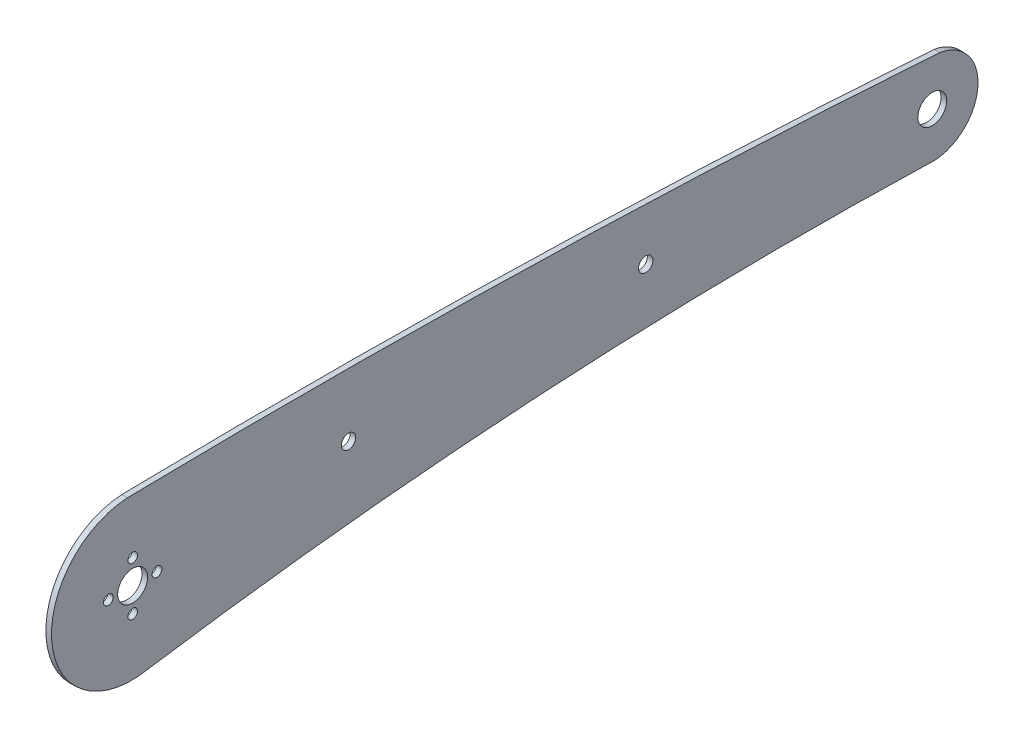
ISO-10303-21;
HEADER;
FILE_DESCRIPTION(('STEP AP214'),'2;1');
FILE_NAME('part.step','',(''),(''),'','','');
FILE_SCHEMA(('AUTOMOTIVE_DESIGN { 1 0 10303 214 1 1 1 1 }'));
ENDSEC;
DATA;
#1=APPLICATION_CONTEXT('core data for automotive mechanical design processes');
#2=APPLICATION_PROTOCOL_DEFINITION('international standard','automotive_design',2000,#1);
#3=PRODUCT_CONTEXT('',#1,'mechanical');
#4=PRODUCT('Part','Part','',(#3));
#5=PRODUCT_RELATED_PRODUCT_CATEGORY('part','',(#4));
#6=PRODUCT_DEFINITION_FORMATION('','',#4);
#7=PRODUCT_DEFINITION_CONTEXT('part definition',#1,'design');
#8=PRODUCT_DEFINITION('design','',#6,#7);
#9=PRODUCT_DEFINITION_SHAPE('','',#8);
#10=(LENGTH_UNIT() NAMED_UNIT(*) SI_UNIT(.MILLI.,.METRE.));
#11=(NAMED_UNIT(*) PLANE_ANGLE_UNIT() SI_UNIT($,.RADIAN.));
#12=(NAMED_UNIT(*) SI_UNIT($,.STERADIAN.) SOLID_ANGLE_UNIT());
#13=UNCERTAINTY_MEASURE_WITH_UNIT(LENGTH_MEASURE(1.E-05),#10,'distance_accuracy_value','');
#14=(GEOMETRIC_REPRESENTATION_CONTEXT(3) GLOBAL_UNCERTAINTY_ASSIGNED_CONTEXT((#13)) GLOBAL_UNIT_ASSIGNED_CONTEXT((#10,
#11,#12)) REPRESENTATION_CONTEXT('',''));
#15=CARTESIAN_POINT('',(0.,0.,0.));
#16=DIRECTION('',(0.,0.,1.));
#17=DIRECTION('',(1.,0.,0.));
#18=AXIS2_PLACEMENT_3D('',#15,#16,#17);
#19=CARTESIAN_POINT('',(1.5,0.0109238249300647,-111.842380336312));
#20=DIRECTION('',(1.,0.,0.));
#21=DIRECTION('',(0.,0.,-1.));
#22=AXIS2_PLACEMENT_3D('',#19,#20,#21);
#23=PLANE('',#22);
#24=CARTESIAN_POINT('',(1.5,4.68666504729787,44.4328136526777));
#25=DIRECTION('',(1.,0.,0.));
#26=DIRECTION('',(0.,0.,-1.));
#27=AXIS2_PLACEMENT_3D('',#24,#25,#26);
#28=CIRCLE('',#27,1.92499999999995);
#29=CARTESIAN_POINT('',(1.5,4.68666504729787,42.5078136526778));
#30=VERTEX_POINT('',#29);
#31=EDGE_CURVE('E187',#30,#30,#28,.T.);
#32=ORIENTED_EDGE('',*,*,#31,.F.);
#33=EDGE_LOOP('',(#32));
#34=FACE_BOUND('',#33,.T.);
#35=CARTESIAN_POINT('',(1.5,0.133331517138124,102.143981394812));
#36=DIRECTION('',(1.,0.,0.));
#37=DIRECTION('',(0.,0.,-1.));
#38=AXIS2_PLACEMENT_3D('',#35,#36,#37);
#39=CIRCLE('',#38,4.00000000000001);
#40=CARTESIAN_POINT('',(1.5,0.133331517138124,98.1439813948124));
#41=VERTEX_POINT('',#40);
#42=EDGE_CURVE('E199',#41,#41,#39,.T.);
#43=ORIENTED_EDGE('',*,*,#42,.F.);
#44=EDGE_LOOP('',(#43));
#45=FACE_BOUND('',#44,.T.);
#46=CARTESIAN_POINT('',(1.5,-6.36666848286188,102.143981394812));
#47=DIRECTION('',(1.,0.,0.));
#48=DIRECTION('',(0.,0.,-1.));
#49=AXIS2_PLACEMENT_3D('',#46,#47,#48);
#50=CIRCLE('',#49,1.29999999999999);
#51=CARTESIAN_POINT('',(1.5,-6.36666848286188,100.843981394812));
#52=VERTEX_POINT('',#51);
#53=EDGE_CURVE('E211',#52,#52,#50,.T.);
#54=ORIENTED_EDGE('',*,*,#53,.F.);
#55=EDGE_LOOP('',(#54));
#56=FACE_BOUND('',#55,.T.);
#57=CARTESIAN_POINT('',(1.5,6.63333151713812,102.143981394812));
#58=DIRECTION('',(1.,0.,0.));
#59=DIRECTION('',(0.,0.,-1.));
#60=AXIS2_PLACEMENT_3D('',#57,#58,#59);
#61=CIRCLE('',#60,1.29999999999999);
#62=CARTESIAN_POINT('',(1.5,6.63333151713812,100.843981394812));
#63=VERTEX_POINT('',#62);
#64=EDGE_CURVE('E111',#63,#63,#61,.T.);
#65=ORIENTED_EDGE('',*,*,#64,.F.);
#66=EDGE_LOOP('',(#65));
#67=FACE_BOUND('',#66,.T.);
#68=CARTESIAN_POINT('',(1.5,-3.59948538258381,-112.079421326813));
#69=DIRECTION('',(1.,0.,0.));
#70=DIRECTION('',(0.,0.,-1.));
#71=AXIS2_PLACEMENT_3D('',#68,#69,#70);
#72=CIRCLE('',#71,4.9999999999999);
#73=CARTESIAN_POINT('',(1.5,-8.57201186270506,-111.555989951663));
#74=VERTEX_POINT('',#73);
#75=CARTESIAN_POINT('',(1.5,-8.58874368837342,-112.406990492162));
#76=VERTEX_POINT('',#75);
#77=EDGE_CURVE('E116',#74,#76,#72,.T.);
#78=ORIENTED_EDGE('',*,*,#77,.T.);
#79=CARTESIAN_POINT('',(1.5,3.62133303244394,-111.605339345811));
#80=DIRECTION('',(1.,0.,0.));
#81=DIRECTION('',(0.,0.,-1.));
#82=AXIS2_PLACEMENT_3D('',#79,#80,#81);
#83=CIRCLE('',#82,12.2363645781209);
#84=CARTESIAN_POINT('',(1.5,15.6965768285633,-113.584507189356));
#85=VERTEX_POINT('',#84);
#86=EDGE_CURVE('E83',#76,#85,#83,.T.);
#87=ORIENTED_EDGE('',*,*,#86,.T.);
#88=CARTESIAN_POINT('',(1.5,-2413.07294376536,56.6324226054489));
#89=DIRECTION('',(1.,0.,0.));
#90=DIRECTION('',(0.,0.,-1.));
#91=AXIS2_PLACEMENT_3D('',#88,#89,#90);
#92=CIRCLE('',#91,2434.72692254281);
#93=CARTESIAN_POINT('',(1.5,21.2020403196569,103.541794938654));
#94=VERTEX_POINT('',#93);
#95=EDGE_CURVE('E87',#85,#94,#92,.T.);
#96=ORIENTED_EDGE('',*,*,#95,.T.);
#97=CARTESIAN_POINT('',(1.5,-0.210717527640014,102.398442674119));
#98=DIRECTION('',(1.,0.,0.));
#99=DIRECTION('',(0.,0.,-1.));
#100=AXIS2_PLACEMENT_3D('',#97,#98,#99);
#101=CIRCLE('',#100,21.4432612498145);
#102=CARTESIAN_POINT('',(1.5,-21.2449303278428,98.2300683023075));
#103=VERTEX_POINT('',#102);
#104=EDGE_CURVE('E91',#94,#103,#101,.T.);
#105=ORIENTED_EDGE('',*,*,#104,.T.);
#106=CARTESIAN_POINT('',(1.5,-1165.50616564437,-76.1691562818783));
#107=DIRECTION('',(-1.,0.,0.));
#108=DIRECTION('',(0.,0.,-1.));
#109=AXIS2_PLACEMENT_3D('',#106,#107,#108);
#110=CIRCLE('',#109,1157.475211045);
#111=EDGE_CURVE('E49',#103,#74,#110,.T.);
#112=ORIENTED_EDGE('',*,*,#111,.T.);
#113=EDGE_LOOP('',(#78,#87,#96,#105,#112));
#114=FACE_BOUND('',#113,.T.);
#115=CARTESIAN_POINT('',(1.5,0.133331517138118,108.643981394812));
#116=DIRECTION('',(1.,0.,0.));
#117=DIRECTION('',(0.,0.,1.));
#118=AXIS2_PLACEMENT_3D('',#115,#116,#117);
#119=CIRCLE('',#118,1.29999999999999);
#120=CARTESIAN_POINT('',(1.5,0.133331517138118,109.943981394812));
#121=VERTEX_POINT('',#120);
#122=EDGE_CURVE('E217',#121,#121,#119,.T.);
#123=ORIENTED_EDGE('',*,*,#122,.F.);
#124=EDGE_LOOP('',(#123));
#125=FACE_BOUND('',#124,.T.);
#126=CARTESIAN_POINT('',(1.5,0.133331517138144,95.6439813948124));
#127=DIRECTION('',(1.,0.,0.));
#128=DIRECTION('',(0.,0.,1.));
#129=AXIS2_PLACEMENT_3D('',#126,#127,#128);
#130=CIRCLE('',#129,1.3);
#131=CARTESIAN_POINT('',(1.5,0.133331517138144,96.9439813948124));
#132=VERTEX_POINT('',#131);
#133=EDGE_CURVE('E205',#132,#132,#130,.T.);
#134=ORIENTED_EDGE('',*,*,#133,.F.);
#135=EDGE_LOOP('',(#134));
#136=FACE_BOUND('',#135,.T.);
#137=CARTESIAN_POINT('',(1.5,5.98288182663587,-35.0010555414686));
#138=DIRECTION('',(1.,0.,0.));
#139=DIRECTION('',(0.,0.,-1.));
#140=AXIS2_PLACEMENT_3D('',#137,#138,#139);
#141=CIRCLE('',#140,1.92499999999995);
#142=CARTESIAN_POINT('',(1.5,5.98288182663587,-36.9260555414685));
#143=VERTEX_POINT('',#142);
#144=EDGE_CURVE('E193',#143,#143,#141,.T.);
#145=ORIENTED_EDGE('',*,*,#144,.F.);
#146=EDGE_LOOP('',(#145));
#147=FACE_BOUND('',#146,.T.);
#148=CARTESIAN_POINT('',(1.5,3.62133303244394,-111.605339345811));
#149=DIRECTION('',(1.,0.,0.));
#150=DIRECTION('',(0.,0.,-1.));
#151=AXIS2_PLACEMENT_3D('',#148,#149,#150);
#152=CIRCLE('',#151,3.85);
#153=CARTESIAN_POINT('',(1.5,3.62133303244394,-115.455339345811));
#154=VERTEX_POINT('',#153);
#155=EDGE_CURVE('E178',#154,#154,#152,.T.);
#156=ORIENTED_EDGE('',*,*,#155,.F.);
#157=EDGE_LOOP('',(#156));
#158=FACE_BOUND('',#157,.T.);
#159=ADVANCED_FACE('F32',(#34,#45,#56,#67,#114,#125,#136,#147,#158),#23,.T.);
#160=CARTESIAN_POINT('',(0.,0.0109238249300647,-111.842380336312));
#161=DIRECTION('',(1.,0.,0.));
#162=DIRECTION('',(0.,0.,-1.));
#163=AXIS2_PLACEMENT_3D('',#160,#161,#162);
#164=PLANE('',#163);
#165=CARTESIAN_POINT('',(0.,-3.59948538258381,-112.079421326813));
#166=DIRECTION('',(1.,0.,0.));
#167=DIRECTION('',(0.,0.,-1.));
#168=AXIS2_PLACEMENT_3D('',#165,#166,#167);
#169=CIRCLE('',#168,4.9999999999999);
#170=CARTESIAN_POINT('',(0.,-8.57201186270506,-111.555989951663));
#171=VERTEX_POINT('',#170);
#172=CARTESIAN_POINT('',(0.,-8.58874368837342,-112.406990492162));
#173=VERTEX_POINT('',#172);
#174=EDGE_CURVE('E107',#171,#173,#169,.T.);
#175=ORIENTED_EDGE('',*,*,#174,.F.);
#176=CARTESIAN_POINT('',(0.,-1165.50616564437,-76.1691562818783));
#177=DIRECTION('',(-1.,0.,0.));
#178=DIRECTION('',(0.,0.,-1.));
#179=AXIS2_PLACEMENT_3D('',#176,#177,#178);
#180=CIRCLE('',#179,1157.475211045);
#181=CARTESIAN_POINT('',(0.,-21.2449303278428,98.2300683023075));
#182=VERTEX_POINT('',#181);
#183=EDGE_CURVE('E75',#182,#171,#180,.T.);
#184=ORIENTED_EDGE('',*,*,#183,.F.);
#185=CARTESIAN_POINT('',(0.,-0.210717527640014,102.398442674119));
#186=DIRECTION('',(1.,0.,0.));
#187=DIRECTION('',(0.,0.,-1.));
#188=AXIS2_PLACEMENT_3D('',#185,#186,#187);
#189=CIRCLE('',#188,21.4432612498145);
#190=CARTESIAN_POINT('',(0.,21.2020403196569,103.541794938654));
#191=VERTEX_POINT('',#190);
#192=EDGE_CURVE('E69',#191,#182,#189,.T.);
#193=ORIENTED_EDGE('',*,*,#192,.F.);
#194=CARTESIAN_POINT('',(0.,-2413.07294376536,56.6324226054489));
#195=DIRECTION('',(1.,0.,0.));
#196=DIRECTION('',(0.,0.,-1.));
#197=AXIS2_PLACEMENT_3D('',#194,#195,#196);
#198=CIRCLE('',#197,2434.72692254281);
#199=CARTESIAN_POINT('',(0.,15.6965768285633,-113.584507189356));
#200=VERTEX_POINT('',#199);
#201=EDGE_CURVE('E98',#200,#191,#198,.T.);
#202=ORIENTED_EDGE('',*,*,#201,.F.);
#203=CARTESIAN_POINT('',(0.,3.62133303244394,-111.605339345811));
#204=DIRECTION('',(1.,0.,0.));
#205=DIRECTION('',(0.,0.,-1.));
#206=AXIS2_PLACEMENT_3D('',#203,#204,#205);
#207=CIRCLE('',#206,12.2363645781209);
#208=EDGE_CURVE('E110',#173,#200,#207,.T.);
#209=ORIENTED_EDGE('',*,*,#208,.F.);
#210=EDGE_LOOP('',(#175,#184,#193,#202,#209));
#211=FACE_BOUND('',#210,.T.);
#212=CARTESIAN_POINT('',(0.,6.63333151713812,102.143981394812));
#213=DIRECTION('',(1.,0.,0.));
#214=DIRECTION('',(0.,0.,-1.));
#215=AXIS2_PLACEMENT_3D('',#212,#213,#214);
#216=CIRCLE('',#215,1.29999999999999);
#217=CARTESIAN_POINT('',(0.,6.63333151713812,100.843981394812));
#218=VERTEX_POINT('',#217);
#219=EDGE_CURVE('E220',#218,#218,#216,.T.);
#220=ORIENTED_EDGE('',*,*,#219,.T.);
#221=EDGE_LOOP('',(#220));
#222=FACE_BOUND('',#221,.T.);
#223=CARTESIAN_POINT('',(0.,0.133331517138118,108.643981394812));
#224=DIRECTION('',(1.,0.,0.));
#225=DIRECTION('',(0.,0.,1.));
#226=AXIS2_PLACEMENT_3D('',#223,#224,#225);
#227=CIRCLE('',#226,1.29999999999999);
#228=CARTESIAN_POINT('',(0.,0.133331517138118,109.943981394812));
#229=VERTEX_POINT('',#228);
#230=EDGE_CURVE('E214',#229,#229,#227,.T.);
#231=ORIENTED_EDGE('',*,*,#230,.T.);
#232=EDGE_LOOP('',(#231));
#233=FACE_BOUND('',#232,.T.);
#234=CARTESIAN_POINT('',(0.,-6.36666848286188,102.143981394812));
#235=DIRECTION('',(1.,0.,0.));
#236=DIRECTION('',(0.,0.,-1.));
#237=AXIS2_PLACEMENT_3D('',#234,#235,#236);
#238=CIRCLE('',#237,1.29999999999999);
#239=CARTESIAN_POINT('',(0.,-6.36666848286188,100.843981394812));
#240=VERTEX_POINT('',#239);
#241=EDGE_CURVE('E208',#240,#240,#238,.T.);
#242=ORIENTED_EDGE('',*,*,#241,.T.);
#243=EDGE_LOOP('',(#242));
#244=FACE_BOUND('',#243,.T.);
#245=CARTESIAN_POINT('',(0.,0.133331517138144,95.6439813948124));
#246=DIRECTION('',(1.,0.,0.));
#247=DIRECTION('',(0.,0.,1.));
#248=AXIS2_PLACEMENT_3D('',#245,#246,#247);
#249=CIRCLE('',#248,1.3);
#250=CARTESIAN_POINT('',(0.,0.133331517138144,96.9439813948124));
#251=VERTEX_POINT('',#250);
#252=EDGE_CURVE('E202',#251,#251,#249,.T.);
#253=ORIENTED_EDGE('',*,*,#252,.T.);
#254=EDGE_LOOP('',(#253));
#255=FACE_BOUND('',#254,.T.);
#256=CARTESIAN_POINT('',(0.,0.133331517138124,102.143981394812));
#257=DIRECTION('',(1.,0.,0.));
#258=DIRECTION('',(0.,0.,-1.));
#259=AXIS2_PLACEMENT_3D('',#256,#257,#258);
#260=CIRCLE('',#259,4.00000000000001);
#261=CARTESIAN_POINT('',(0.,0.133331517138124,98.1439813948124));
#262=VERTEX_POINT('',#261);
#263=EDGE_CURVE('E196',#262,#262,#260,.T.);
#264=ORIENTED_EDGE('',*,*,#263,.T.);
#265=EDGE_LOOP('',(#264));
#266=FACE_BOUND('',#265,.T.);
#267=CARTESIAN_POINT('',(0.,5.98288182663587,-35.0010555414686));
#268=DIRECTION('',(1.,0.,0.));
#269=DIRECTION('',(0.,0.,-1.));
#270=AXIS2_PLACEMENT_3D('',#267,#268,#269);
#271=CIRCLE('',#270,1.92499999999995);
#272=CARTESIAN_POINT('',(0.,5.98288182663587,-36.9260555414685));
#273=VERTEX_POINT('',#272);
#274=EDGE_CURVE('E190',#273,#273,#271,.T.);
#275=ORIENTED_EDGE('',*,*,#274,.T.);
#276=EDGE_LOOP('',(#275));
#277=FACE_BOUND('',#276,.T.);
#278=CARTESIAN_POINT('',(0.,4.68666504729787,44.4328136526777));
#279=DIRECTION('',(1.,0.,0.));
#280=DIRECTION('',(0.,0.,-1.));
#281=AXIS2_PLACEMENT_3D('',#278,#279,#280);
#282=CIRCLE('',#281,1.92499999999995);
#283=CARTESIAN_POINT('',(0.,4.68666504729787,42.5078136526778));
#284=VERTEX_POINT('',#283);
#285=EDGE_CURVE('E184',#284,#284,#282,.T.);
#286=ORIENTED_EDGE('',*,*,#285,.T.);
#287=EDGE_LOOP('',(#286));
#288=FACE_BOUND('',#287,.T.);
#289=CARTESIAN_POINT('',(0.,3.62133303244394,-111.605339345811));
#290=DIRECTION('',(1.,0.,0.));
#291=DIRECTION('',(0.,0.,-1.));
#292=AXIS2_PLACEMENT_3D('',#289,#290,#291);
#293=CIRCLE('',#292,3.85);
#294=CARTESIAN_POINT('',(0.,3.62133303244394,-115.455339345811));
#295=VERTEX_POINT('',#294);
#296=EDGE_CURVE('E181',#295,#295,#293,.T.);
#297=ORIENTED_EDGE('',*,*,#296,.T.);
#298=EDGE_LOOP('',(#297));
#299=FACE_BOUND('',#298,.T.);
#300=ADVANCED_FACE('F120',(#211,#222,#233,#244,#255,#266,#277,#288,#299),#164,.F.);
#301=CARTESIAN_POINT('',(1.5,-3.59948538258381,-112.079421326813));
#302=DIRECTION('',(-1.,0.,0.));
#303=DIRECTION('',(0.,0.,1.));
#304=AXIS2_PLACEMENT_3D('',#301,#302,#303);
#305=CYLINDRICAL_SURFACE('',#304,4.9999999999999);
#306=ORIENTED_EDGE('',*,*,#174,.T.);
#307=DIRECTION('',(-1.,0.,0.));
#308=VECTOR('',#307,1.);
#309=CARTESIAN_POINT('',(1.5,-8.58874368837342,-112.406990492162));
#310=LINE('',#309,#308);
#311=EDGE_CURVE('E11',#76,#173,#310,.T.);
#312=ORIENTED_EDGE('',*,*,#311,.F.);
#313=ORIENTED_EDGE('',*,*,#77,.F.);
#314=DIRECTION('',(-1.,0.,0.));
#315=VECTOR('',#314,1.);
#316=CARTESIAN_POINT('',(1.5,-8.57201186270506,-111.555989951663));
#317=LINE('',#316,#315);
#318=EDGE_CURVE('E103',#74,#171,#317,.T.);
#319=ORIENTED_EDGE('',*,*,#318,.T.);
#320=EDGE_LOOP('',(#306,#312,#313,#319));
#321=FACE_BOUND('',#320,.T.);
#322=ADVANCED_FACE('F34',(#321),#305,.T.);
#323=CARTESIAN_POINT('',(1.5,3.62133303244394,-111.605339345811));
#324=DIRECTION('',(-1.,0.,0.));
#325=DIRECTION('',(0.,0.,1.));
#326=AXIS2_PLACEMENT_3D('',#323,#324,#325);
#327=CYLINDRICAL_SURFACE('',#326,12.2363645781209);
#328=ORIENTED_EDGE('',*,*,#208,.T.);
#329=DIRECTION('',(-1.,0.,0.));
#330=VECTOR('',#329,1.);
#331=CARTESIAN_POINT('',(1.5,15.6965768285633,-113.584507189356));
#332=LINE('',#331,#330);
#333=EDGE_CURVE('E41',#85,#200,#332,.T.);
#334=ORIENTED_EDGE('',*,*,#333,.F.);
#335=ORIENTED_EDGE('',*,*,#86,.F.);
#336=ORIENTED_EDGE('',*,*,#311,.T.);
#337=EDGE_LOOP('',(#328,#334,#335,#336));
#338=FACE_BOUND('',#337,.T.);
#339=ADVANCED_FACE('F305',(#338),#327,.T.);
#340=CARTESIAN_POINT('',(1.5,-2413.07294376536,56.6324226054489));
#341=DIRECTION('',(-1.,0.,0.));
#342=DIRECTION('',(0.,0.,1.));
#343=AXIS2_PLACEMENT_3D('',#340,#341,#342);
#344=CYLINDRICAL_SURFACE('',#343,2434.72692254281);
#345=ORIENTED_EDGE('',*,*,#201,.T.);
#346=DIRECTION('',(-1.,0.,0.));
#347=VECTOR('',#346,1.);
#348=CARTESIAN_POINT('',(1.5,21.2020403196569,103.541794938654));
#349=LINE('',#348,#347);
#350=EDGE_CURVE('E95',#94,#191,#349,.T.);
#351=ORIENTED_EDGE('',*,*,#350,.F.);
#352=ORIENTED_EDGE('',*,*,#95,.F.);
#353=ORIENTED_EDGE('',*,*,#333,.T.);
#354=EDGE_LOOP('',(#345,#351,#352,#353));
#355=FACE_BOUND('',#354,.T.);
#356=ADVANCED_FACE('F96',(#355),#344,.T.);
#357=CARTESIAN_POINT('',(1.5,-0.210717527640014,102.398442674119));
#358=DIRECTION('',(-1.,0.,0.));
#359=DIRECTION('',(0.,0.,1.));
#360=AXIS2_PLACEMENT_3D('',#357,#358,#359);
#361=CYLINDRICAL_SURFACE('',#360,21.4432612498145);
#362=ORIENTED_EDGE('',*,*,#192,.T.);
#363=DIRECTION('',(-1.,0.,0.));
#364=VECTOR('',#363,1.);
#365=CARTESIAN_POINT('',(1.5,-21.2449303278428,98.2300683023075));
#366=LINE('',#365,#364);
#367=EDGE_CURVE('E99',#103,#182,#366,.T.);
#368=ORIENTED_EDGE('',*,*,#367,.F.);
#369=ORIENTED_EDGE('',*,*,#104,.F.);
#370=ORIENTED_EDGE('',*,*,#350,.T.);
#371=EDGE_LOOP('',(#362,#368,#369,#370));
#372=FACE_BOUND('',#371,.T.);
#373=ADVANCED_FACE('F101',(#372),#361,.T.);
#374=CARTESIAN_POINT('',(1.5,-1165.50616564437,-76.1691562818783));
#375=DIRECTION('',(-1.,0.,0.));
#376=DIRECTION('',(0.,0.,1.));
#377=AXIS2_PLACEMENT_3D('',#374,#375,#376);
#378=CYLINDRICAL_SURFACE('',#377,1157.475211045);
#379=ORIENTED_EDGE('',*,*,#183,.T.);
#380=ORIENTED_EDGE('',*,*,#318,.F.);
#381=ORIENTED_EDGE('',*,*,#111,.F.);
#382=ORIENTED_EDGE('',*,*,#367,.T.);
#383=EDGE_LOOP('',(#379,#380,#381,#382));
#384=FACE_BOUND('',#383,.T.);
#385=ADVANCED_FACE('F125',(#384),#378,.F.);
#386=CARTESIAN_POINT('',(1.5,6.63333151713812,102.143981394812));
#387=DIRECTION('',(-1.,0.,0.));
#388=DIRECTION('',(0.,0.,1.));
#389=AXIS2_PLACEMENT_3D('',#386,#387,#388);
#390=CYLINDRICAL_SURFACE('',#389,1.29999999999999);
#391=ORIENTED_EDGE('',*,*,#64,.T.);
#392=EDGE_LOOP('',(#391));
#393=FACE_BOUND('',#392,.T.);
#394=ORIENTED_EDGE('',*,*,#219,.F.);
#395=EDGE_LOOP('',(#394));
#396=FACE_BOUND('',#395,.T.);
#397=ADVANCED_FACE('F127',(#393,#396),#390,.F.);
#398=CARTESIAN_POINT('',(1.5,0.133331517138118,108.643981394812));
#399=DIRECTION('',(-1.,0.,0.));
#400=DIRECTION('',(0.,0.,1.));
#401=AXIS2_PLACEMENT_3D('',#398,#399,#400);
#402=CYLINDRICAL_SURFACE('',#401,1.29999999999999);
#403=ORIENTED_EDGE('',*,*,#122,.T.);
#404=EDGE_LOOP('',(#403));
#405=FACE_BOUND('',#404,.T.);
#406=ORIENTED_EDGE('',*,*,#230,.F.);
#407=EDGE_LOOP('',(#406));
#408=FACE_BOUND('',#407,.T.);
#409=ADVANCED_FACE('F133',(#405,#408),#402,.F.);
#410=CARTESIAN_POINT('',(1.5,-6.36666848286188,102.143981394812));
#411=DIRECTION('',(-1.,0.,0.));
#412=DIRECTION('',(0.,0.,1.));
#413=AXIS2_PLACEMENT_3D('',#410,#411,#412);
#414=CYLINDRICAL_SURFACE('',#413,1.29999999999999);
#415=ORIENTED_EDGE('',*,*,#53,.T.);
#416=EDGE_LOOP('',(#415));
#417=FACE_BOUND('',#416,.T.);
#418=ORIENTED_EDGE('',*,*,#241,.F.);
#419=EDGE_LOOP('',(#418));
#420=FACE_BOUND('',#419,.T.);
#421=ADVANCED_FACE('F149',(#417,#420),#414,.F.);
#422=CARTESIAN_POINT('',(1.5,0.133331517138144,95.6439813948124));
#423=DIRECTION('',(-1.,0.,0.));
#424=DIRECTION('',(0.,0.,1.));
#425=AXIS2_PLACEMENT_3D('',#422,#423,#424);
#426=CYLINDRICAL_SURFACE('',#425,1.3);
#427=ORIENTED_EDGE('',*,*,#133,.T.);
#428=EDGE_LOOP('',(#427));
#429=FACE_BOUND('',#428,.T.);
#430=ORIENTED_EDGE('',*,*,#252,.F.);
#431=EDGE_LOOP('',(#430));
#432=FACE_BOUND('',#431,.T.);
#433=ADVANCED_FACE('F153',(#429,#432),#426,.F.);
#434=CARTESIAN_POINT('',(1.5,0.133331517138124,102.143981394812));
#435=DIRECTION('',(-1.,0.,0.));
#436=DIRECTION('',(0.,0.,1.));
#437=AXIS2_PLACEMENT_3D('',#434,#435,#436);
#438=CYLINDRICAL_SURFACE('',#437,4.00000000000001);
#439=ORIENTED_EDGE('',*,*,#42,.T.);
#440=EDGE_LOOP('',(#439));
#441=FACE_BOUND('',#440,.T.);
#442=ORIENTED_EDGE('',*,*,#263,.F.);
#443=EDGE_LOOP('',(#442));
#444=FACE_BOUND('',#443,.T.);
#445=ADVANCED_FACE('F157',(#441,#444),#438,.F.);
#446=CARTESIAN_POINT('',(1.5,5.98288182663587,-35.0010555414686));
#447=DIRECTION('',(-1.,0.,0.));
#448=DIRECTION('',(0.,0.,1.));
#449=AXIS2_PLACEMENT_3D('',#446,#447,#448);
#450=CYLINDRICAL_SURFACE('',#449,1.92499999999995);
#451=ORIENTED_EDGE('',*,*,#144,.T.);
#452=EDGE_LOOP('',(#451));
#453=FACE_BOUND('',#452,.T.);
#454=ORIENTED_EDGE('',*,*,#274,.F.);
#455=EDGE_LOOP('',(#454));
#456=FACE_BOUND('',#455,.T.);
#457=ADVANCED_FACE('F161',(#453,#456),#450,.F.);
#458=CARTESIAN_POINT('',(1.5,4.68666504729787,44.4328136526777));
#459=DIRECTION('',(-1.,0.,0.));
#460=DIRECTION('',(0.,0.,1.));
#461=AXIS2_PLACEMENT_3D('',#458,#459,#460);
#462=CYLINDRICAL_SURFACE('',#461,1.92499999999995);
#463=ORIENTED_EDGE('',*,*,#31,.T.);
#464=EDGE_LOOP('',(#463));
#465=FACE_BOUND('',#464,.T.);
#466=ORIENTED_EDGE('',*,*,#285,.F.);
#467=EDGE_LOOP('',(#466));
#468=FACE_BOUND('',#467,.T.);
#469=ADVANCED_FACE('F165',(#465,#468),#462,.F.);
#470=CARTESIAN_POINT('',(1.5,3.62133303244394,-111.605339345811));
#471=DIRECTION('',(-1.,0.,0.));
#472=DIRECTION('',(0.,0.,1.));
#473=AXIS2_PLACEMENT_3D('',#470,#471,#472);
#474=CYLINDRICAL_SURFACE('',#473,3.85);
#475=ORIENTED_EDGE('',*,*,#155,.T.);
#476=EDGE_LOOP('',(#475));
#477=FACE_BOUND('',#476,.T.);
#478=ORIENTED_EDGE('',*,*,#296,.F.);
#479=EDGE_LOOP('',(#478));
#480=FACE_BOUND('',#479,.T.);
#481=ADVANCED_FACE('F169',(#477,#480),#474,.F.);
#482=CLOSED_SHELL('',(#159,#300,#322,#339,#356,#373,#385,#397,#409,#421,#433,#445,#457,#469,#481));
#483=MANIFOLD_SOLID_BREP('B2',#482);
#484=ADVANCED_BREP_SHAPE_REPRESENTATION('',(#18,#483),#14);
#485=SHAPE_DEFINITION_REPRESENTATION(#9,#484);
ENDSEC;
END-ISO-10303-21;
